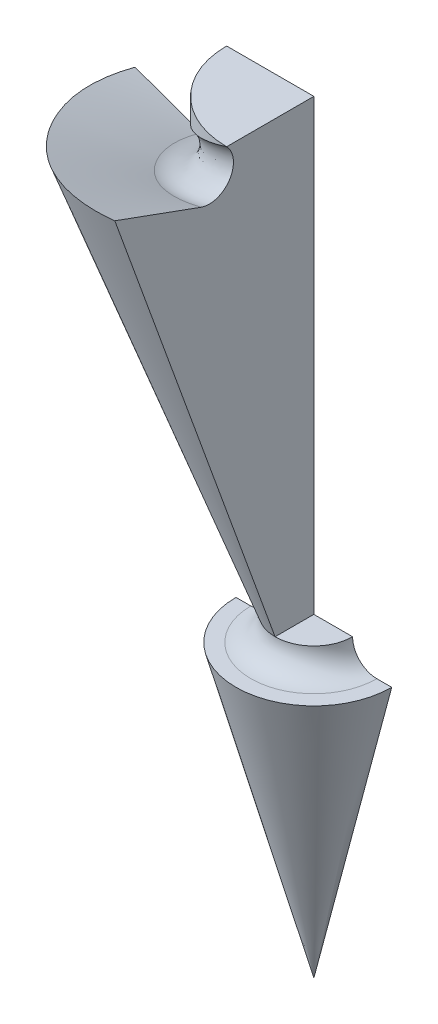
ISO-10303-21;
HEADER;
FILE_DESCRIPTION(('STEP AP214'),'2;1');
FILE_NAME('part.step','',(''),(''),'','','');
FILE_SCHEMA(('AUTOMOTIVE_DESIGN { 1 0 10303 214 1 1 1 1 }'));
ENDSEC;
DATA;
#1=APPLICATION_CONTEXT('core data for automotive mechanical design processes');
#2=APPLICATION_PROTOCOL_DEFINITION('international standard','automotive_design',2000,#1);
#3=PRODUCT_CONTEXT('',#1,'mechanical');
#4=PRODUCT('Part','Part','',(#3));
#5=PRODUCT_RELATED_PRODUCT_CATEGORY('part','',(#4));
#6=PRODUCT_DEFINITION_FORMATION('','',#4);
#7=PRODUCT_DEFINITION_CONTEXT('part definition',#1,'design');
#8=PRODUCT_DEFINITION('design','',#6,#7);
#9=PRODUCT_DEFINITION_SHAPE('','',#8);
#10=(LENGTH_UNIT() NAMED_UNIT(*) SI_UNIT(.MILLI.,.METRE.));
#11=(NAMED_UNIT(*) PLANE_ANGLE_UNIT() SI_UNIT($,.RADIAN.));
#12=(NAMED_UNIT(*) SI_UNIT($,.STERADIAN.) SOLID_ANGLE_UNIT());
#13=UNCERTAINTY_MEASURE_WITH_UNIT(LENGTH_MEASURE(1.E-05),#10,'distance_accuracy_value','');
#14=(GEOMETRIC_REPRESENTATION_CONTEXT(3) GLOBAL_UNCERTAINTY_ASSIGNED_CONTEXT((#13)) GLOBAL_UNIT_ASSIGNED_CONTEXT((#10,
#11,#12)) REPRESENTATION_CONTEXT('',''));
#15=CARTESIAN_POINT('',(0.,0.,0.));
#16=DIRECTION('',(0.,0.,1.));
#17=DIRECTION('',(1.,0.,0.));
#18=AXIS2_PLACEMENT_3D('',#15,#16,#17);
#19=CARTESIAN_POINT('',(0.65,3.25,0.));
#20=DIRECTION('',(0.,0.,1.));
#21=DIRECTION('',(1.,0.,0.));
#22=AXIS2_PLACEMENT_3D('',#19,#20,#21);
#23=PLANE('',#22);
#24=DIRECTION('',(0.939692620785907,-0.342020143325673,0.));
#25=VECTOR('',#24,1.);
#26=CARTESIAN_POINT('',(-2.05422252667127,7.29493903878258,0.));
#27=LINE('',#26,#25);
#28=CARTESIAN_POINT('',(-1.84444761887696,7.21858721644951,0.));
#29=VERTEX_POINT('',#28);
#30=CARTESIAN_POINT('',(-1.16533998591608,6.97141225218877,0.));
#31=VERTEX_POINT('',#30);
#32=EDGE_CURVE('E105',#29,#31,#27,.T.);
#33=ORIENTED_EDGE('',*,*,#32,.T.);
#34=CARTESIAN_POINT('',(-1.07983495008466,7.20633540738525,0.));
#35=DIRECTION('',(0.,0.,1.));
#36=DIRECTION('',(1.,0.,0.));
#37=AXIS2_PLACEMENT_3D('',#34,#35,#36);
#38=CIRCLE('',#37,0.25);
#39=CARTESIAN_POINT('',(-0.9,7.38,0.));
#40=VERTEX_POINT('',#39);
#41=EDGE_CURVE('E298',#31,#40,#38,.T.);
#42=ORIENTED_EDGE('',*,*,#41,.T.);
#43=DIRECTION('',(0.,1.,0.));
#44=VECTOR('',#43,1.);
#45=CARTESIAN_POINT('',(-0.9,7.38,0.));
#46=LINE('',#45,#44);
#47=CARTESIAN_POINT('',(-0.9,7.88,0.));
#48=VERTEX_POINT('',#47);
#49=EDGE_CURVE('E110',#40,#48,#46,.T.);
#50=ORIENTED_EDGE('',*,*,#49,.T.);
#51=DIRECTION('',(-1.,0.,0.));
#52=VECTOR('',#51,1.);
#53=CARTESIAN_POINT('',(0.,7.88,0.));
#54=LINE('',#53,#52);
#55=CARTESIAN_POINT('',(0.,7.88,0.));
#56=VERTEX_POINT('',#55);
#57=EDGE_CURVE('E124',#56,#48,#54,.T.);
#58=ORIENTED_EDGE('',*,*,#57,.F.);
#59=DIRECTION('',(0.,1.,0.));
#60=VECTOR('',#59,1.);
#61=CARTESIAN_POINT('',(0.,2.15100903221813,0.));
#62=LINE('',#61,#60);
#63=CARTESIAN_POINT('',(0.,3.25,0.));
#64=VERTEX_POINT('',#63);
#65=EDGE_CURVE('E54',#64,#56,#62,.T.);
#66=ORIENTED_EDGE('',*,*,#65,.F.);
#67=DIRECTION('',(1.,0.,0.));
#68=VECTOR('',#67,1.);
#69=CARTESIAN_POINT('',(0.,3.25,0.));
#70=LINE('',#69,#68);
#71=CARTESIAN_POINT('',(0.4,3.25,0.));
#72=VERTEX_POINT('',#71);
#73=EDGE_CURVE('E147',#64,#72,#70,.T.);
#74=ORIENTED_EDGE('',*,*,#73,.T.);
#75=CARTESIAN_POINT('',(0.65,3.25,0.));
#76=DIRECTION('',(0.,0.,1.));
#77=DIRECTION('',(1.,0.,0.));
#78=AXIS2_PLACEMENT_3D('',#75,#76,#77);
#79=CIRCLE('',#78,0.25);
#80=CARTESIAN_POINT('',(0.65,3.,0.));
#81=VERTEX_POINT('',#80);
#82=EDGE_CURVE('E149',#72,#81,#79,.T.);
#83=ORIENTED_EDGE('',*,*,#82,.T.);
#84=DIRECTION('',(1.,0.,0.));
#85=VECTOR('',#84,1.);
#86=CARTESIAN_POINT('',(0.65,3.,0.));
#87=LINE('',#86,#85);
#88=CARTESIAN_POINT('',(0.803847577293347,3.,0.));
#89=VERTEX_POINT('',#88);
#90=EDGE_CURVE('E152',#81,#89,#87,.T.);
#91=ORIENTED_EDGE('',*,*,#90,.T.);
#92=DIRECTION('',(-0.258819045102515,-0.96592582628907,0.));
#93=VECTOR('',#92,1.);
#94=CARTESIAN_POINT('',(0.803847577293347,3.,0.));
#95=LINE('',#94,#93);
#96=CARTESIAN_POINT('',(0.,0.,0.));
#97=VERTEX_POINT('',#96);
#98=EDGE_CURVE('E144',#89,#97,#95,.T.);
#99=ORIENTED_EDGE('',*,*,#98,.T.);
#100=DIRECTION('',(0.258819045102515,-0.96592582628907,0.));
#101=VECTOR('',#100,1.);
#102=CARTESIAN_POINT('',(-0.803847577293347,3.,0.));
#103=LINE('',#102,#101);
#104=CARTESIAN_POINT('',(-0.803847577293347,3.,0.));
#105=VERTEX_POINT('',#104);
#106=EDGE_CURVE('E136',#105,#97,#103,.T.);
#107=ORIENTED_EDGE('',*,*,#106,.F.);
#108=DIRECTION('',(-1.,0.,0.));
#109=VECTOR('',#108,1.);
#110=CARTESIAN_POINT('',(-0.65,3.,0.));
#111=LINE('',#110,#109);
#112=CARTESIAN_POINT('',(-0.65,3.,0.));
#113=VERTEX_POINT('',#112);
#114=EDGE_CURVE('E141',#113,#105,#111,.T.);
#115=ORIENTED_EDGE('',*,*,#114,.F.);
#116=CARTESIAN_POINT('',(-0.65,3.25,0.));
#117=DIRECTION('',(0.,0.,-1.));
#118=DIRECTION('',(-1.,0.,0.));
#119=AXIS2_PLACEMENT_3D('',#116,#117,#118);
#120=CIRCLE('',#119,0.25);
#121=CARTESIAN_POINT('',(-0.4,3.25,0.));
#122=VERTEX_POINT('',#121);
#123=EDGE_CURVE('E138',#122,#113,#120,.T.);
#124=ORIENTED_EDGE('',*,*,#123,.F.);
#125=DIRECTION('',(0.342020143325663,-0.939692620785911,0.));
#126=VECTOR('',#125,1.);
#127=CARTESIAN_POINT('',(-2.08518218465248,7.88,0.));
#128=LINE('',#127,#126);
#129=EDGE_CURVE('E109',#29,#122,#128,.T.);
#130=ORIENTED_EDGE('',*,*,#129,.F.);
#131=EDGE_LOOP('',(#33,#42,#50,#58,#66,#74,#83,#91,#99,#107,#115,#124,#130));
#132=FACE_BOUND('',#131,.T.);
#133=ADVANCED_FACE('F32',(#132),#23,.F.);
#134=CARTESIAN_POINT('',(0.,7.88,0.));
#135=DIRECTION('',(0.,1.,0.));
#136=DIRECTION('',(0.,0.,1.));
#137=AXIS2_PLACEMENT_3D('',#134,#135,#136);
#138=CONICAL_SURFACE('',#137,2.08518218465248,0.34906585039886);
#139=CARTESIAN_POINT('',(-1.84444761887696,7.21858721644951,0.));
#140=CARTESIAN_POINT('',(-1.84781471181397,7.22784298486972,0.0444304817928109));
#141=CARTESIAN_POINT('',(-1.84956840188651,7.23707024375933,0.0889683857329345));
#142=CARTESIAN_POINT('',(-1.84983885491136,7.25542953451838,0.178060540194713));
#143=CARTESIAN_POINT('',(-1.84835652285926,7.26456159229438,0.222614782662941));
#144=CARTESIAN_POINT('',(-1.83905486371803,7.29172727015378,0.355854667817407));
#145=CARTESIAN_POINT('',(-1.82639509414649,7.30956964025187,0.444305988826253));
#146=CARTESIAN_POINT('',(-1.79614387865713,7.3372744279236,0.58297518639799));
#147=CARTESIAN_POINT('',(-1.78266444553973,7.34742578708997,0.634085028649661));
#148=CARTESIAN_POINT('',(-1.75133533893838,7.36735735314818,0.735025826969175));
#149=CARTESIAN_POINT('',(-1.73348710712139,7.37713768124998,0.784857198940521));
#150=CARTESIAN_POINT('',(-1.70353106913082,7.39151116660467,0.858374034844452));
#151=CARTESIAN_POINT('',(-1.69300793153647,7.39625554865905,0.882688643430426));
#152=CARTESIAN_POINT('',(-1.67090076326795,7.40559434110859,0.930856361012279));
#153=CARTESIAN_POINT('',(-1.65931691907333,7.41018877767327,0.954709550239116));
#154=CARTESIAN_POINT('',(-1.63520023638637,7.41945297862087,1.00192042869882));
#155=CARTESIAN_POINT('',(-1.62266723882482,7.42412275552645,1.02527803403304));
#156=CARTESIAN_POINT('',(-1.59668461578408,7.43355008637108,1.07145953373859));
#157=CARTESIAN_POINT('',(-1.58323493708113,7.43830764539516,1.09428339701661));
#158=CARTESIAN_POINT('',(-1.54120506317018,7.45280584124422,1.16244232112663));
#159=CARTESIAN_POINT('',(-1.51122948280328,7.46266230768552,1.20690555842916));
#160=CARTESIAN_POINT('',(-1.44781841069014,7.48260350922582,1.29320616344966));
#161=CARTESIAN_POINT('',(-1.41438321277737,7.49268822488233,1.33504375368593));
#162=CARTESIAN_POINT('',(-1.30918566464524,7.5231816082672,1.45624204409056));
#163=CARTESIAN_POINT('',(-1.23248968225225,7.54384389151072,1.53135567963995));
#164=CARTESIAN_POINT('',(-1.06329397173253,7.58644347522577,1.67211421517855));
#165=CARTESIAN_POINT('',(-0.970139524130376,7.60838584058901,1.73696740588334));
#166=CARTESIAN_POINT('',(-0.774030802814063,7.65177088047946,1.84988273640024));
#167=CARTESIAN_POINT('',(-0.671077423342969,7.67321360038203,1.89794640654522));
#168=CARTESIAN_POINT('',(-0.474256700358971,7.71189946447853,1.96999622436579));
#169=CARTESIAN_POINT('',(-0.381333578416707,7.72929103700932,1.99650841962133));
#170=CARTESIAN_POINT('',(-0.192465633964743,7.76299638698439,2.03579516224844));
#171=CARTESIAN_POINT('',(-0.0965215584160749,7.77931042781639,2.04857307852527));
#172=CARTESIAN_POINT('',(0.,7.79493903878258,2.05422252667127));
#173=B_SPLINE_CURVE_WITH_KNOTS('',3,(#139,#140,#141,#142,#143,#144,#145,#146,#147,#148,#149,
#150,#151,#152,#153,#154,#155,#156,#157,#158,#159,#160,#161,#162,#163,#164,#165,#166,#167,#168,
#169,#170,#171,#172),.UNSPECIFIED.,.F.,.F.,(4,2,2,2,2,2,2,2,2,2,2,2,2,2,2,2,4),(0.,
0.136457669262505,0.27287718125609,0.545142011443245,0.706456766055463,0.867718359746195,
0.948444823416402,1.029157121967,1.10988297720473,1.1906135234954,1.3539812697316,
1.51733515213201,1.8438039843095,2.18902516221494,2.53421486565076,2.82777405417575,
3.12126121861064),.UNSPECIFIED.);
#174=CARTESIAN_POINT('',(0.,7.79493903878258,2.05422252667127));
#175=VERTEX_POINT('',#174);
#176=EDGE_CURVE('E98',#29,#175,#173,.T.);
#177=ORIENTED_EDGE('',*,*,#176,.F.);
#178=ORIENTED_EDGE('',*,*,#129,.T.);
#179=CARTESIAN_POINT('',(0.,3.25,0.));
#180=DIRECTION('',(0.,-1.,0.));
#181=DIRECTION('',(0.,0.,-1.));
#182=AXIS2_PLACEMENT_3D('',#179,#180,#181);
#183=CIRCLE('',#182,0.4);
#184=CARTESIAN_POINT('',(0.,3.25,0.4));
#185=VERTEX_POINT('',#184);
#186=EDGE_CURVE('E122',#122,#185,#183,.F.);
#187=ORIENTED_EDGE('',*,*,#186,.T.);
#188=DIRECTION('',(0.,-0.939692620785911,-0.342020143325663));
#189=VECTOR('',#188,1.);
#190=CARTESIAN_POINT('',(0.,7.88,2.08518218465248));
#191=LINE('',#190,#189);
#192=EDGE_CURVE('E115',#175,#185,#191,.T.);
#193=ORIENTED_EDGE('',*,*,#192,.F.);
#194=EDGE_LOOP('',(#177,#178,#187,#193));
#195=FACE_BOUND('',#194,.T.);
#196=ADVANCED_FACE('F120',(#195),#138,.T.);
#197=CARTESIAN_POINT('',(0.,0.,0.));
#198=DIRECTION('',(-1.,0.,0.));
#199=DIRECTION('',(0.,0.,1.));
#200=AXIS2_PLACEMENT_3D('',#197,#198,#199);
#201=PLANE('',#200);
#202=DIRECTION('',(0.,-0.342020143325672,-0.939692620785907));
#203=VECTOR('',#202,1.);
#204=CARTESIAN_POINT('',(0.,7.79493903878258,2.05422252667127));
#205=LINE('',#204,#203);
#206=CARTESIAN_POINT('',(0.,7.47141225218877,1.16533998591608));
#207=VERTEX_POINT('',#206);
#208=EDGE_CURVE('E102',#175,#207,#205,.T.);
#209=ORIENTED_EDGE('',*,*,#208,.F.);
#210=ORIENTED_EDGE('',*,*,#192,.T.);
#211=DIRECTION('',(0.,0.,-1.));
#212=VECTOR('',#211,1.);
#213=CARTESIAN_POINT('',(0.,3.25,0.));
#214=LINE('',#213,#212);
#215=EDGE_CURVE('E133',#185,#64,#214,.T.);
#216=ORIENTED_EDGE('',*,*,#215,.T.);
#217=ORIENTED_EDGE('',*,*,#65,.T.);
#218=DIRECTION('',(0.,0.,1.));
#219=VECTOR('',#218,1.);
#220=CARTESIAN_POINT('',(0.,7.88,0.));
#221=LINE('',#220,#219);
#222=CARTESIAN_POINT('',(0.,7.88,0.9));
#223=VERTEX_POINT('',#222);
#224=EDGE_CURVE('E126',#56,#223,#221,.T.);
#225=ORIENTED_EDGE('',*,*,#224,.T.);
#226=CARTESIAN_POINT('',(0.,7.70633540738525,1.07983495008466));
#227=DIRECTION('',(1.,0.,0.));
#228=DIRECTION('',(0.,0.,-1.));
#229=AXIS2_PLACEMENT_3D('',#226,#227,#228);
#230=CIRCLE('',#229,0.25);
#231=EDGE_CURVE('E118',#207,#223,#230,.T.);
#232=ORIENTED_EDGE('',*,*,#231,.F.);
#233=EDGE_LOOP('',(#209,#210,#216,#217,#225,#232));
#234=FACE_BOUND('',#233,.T.);
#235=ADVANCED_FACE('F114',(#234),#201,.F.);
#236=CARTESIAN_POINT('',(0.,7.88,0.));
#237=DIRECTION('',(0.,-1.,0.));
#238=DIRECTION('',(0.,0.,-1.));
#239=AXIS2_PLACEMENT_3D('',#236,#237,#238);
#240=PLANE('',#239);
#241=CARTESIAN_POINT('',(0.,7.88,0.));
#242=DIRECTION('',(0.,-1.,0.));
#243=DIRECTION('',(0.,0.,-1.));
#244=AXIS2_PLACEMENT_3D('',#241,#242,#243);
#245=CIRCLE('',#244,0.9);
#246=EDGE_CURVE('E11',#223,#48,#245,.T.);
#247=ORIENTED_EDGE('',*,*,#246,.F.);
#248=ORIENTED_EDGE('',*,*,#224,.F.);
#249=ORIENTED_EDGE('',*,*,#57,.T.);
#250=EDGE_LOOP('',(#247,#248,#249));
#251=FACE_BOUND('',#250,.T.);
#252=ADVANCED_FACE('F209',(#251),#240,.F.);
#253=CARTESIAN_POINT('',(0.,3.25,0.));
#254=DIRECTION('',(0.,-1.,0.));
#255=DIRECTION('',(0.,0.,-1.));
#256=AXIS2_PLACEMENT_3D('',#253,#254,#255);
#257=PLANE('',#256);
#258=ORIENTED_EDGE('',*,*,#215,.F.);
#259=CARTESIAN_POINT('',(0.,3.25,0.));
#260=DIRECTION('',(0.,-1.,0.));
#261=DIRECTION('',(0.,0.,-1.));
#262=AXIS2_PLACEMENT_3D('',#259,#260,#261);
#263=CIRCLE('',#262,0.4);
#264=EDGE_CURVE('E155',#72,#185,#263,.T.);
#265=ORIENTED_EDGE('',*,*,#264,.F.);
#266=ORIENTED_EDGE('',*,*,#73,.F.);
#267=EDGE_LOOP('',(#258,#265,#266));
#268=FACE_BOUND('',#267,.T.);
#269=ADVANCED_FACE('F214',(#268),#257,.F.);
#270=CARTESIAN_POINT('',(0.,3.,0.));
#271=DIRECTION('',(0.,1.,0.));
#272=DIRECTION('',(0.,0.,1.));
#273=AXIS2_PLACEMENT_3D('',#270,#271,#272);
#274=CONICAL_SURFACE('',#273,0.803847577293347,0.261799387799143);
#275=CARTESIAN_POINT('',(0.,3.,0.));
#276=DIRECTION('',(0.,-1.,0.));
#277=DIRECTION('',(0.,0.,-1.));
#278=AXIS2_PLACEMENT_3D('',#275,#276,#277);
#279=CIRCLE('',#278,0.803847577293347);
#280=EDGE_CURVE('E40',#89,#105,#279,.T.);
#281=ORIENTED_EDGE('',*,*,#280,.T.);
#282=ORIENTED_EDGE('',*,*,#106,.T.);
#283=ORIENTED_EDGE('',*,*,#98,.F.);
#284=EDGE_LOOP('',(#281,#282,#283));
#285=FACE_BOUND('',#284,.T.);
#286=ADVANCED_FACE('F161',(#285),#274,.T.);
#287=CARTESIAN_POINT('',(0.65,3.,0.));
#288=DIRECTION('',(0.,-1.,0.));
#289=DIRECTION('',(0.,0.,-1.));
#290=AXIS2_PLACEMENT_3D('',#287,#288,#289);
#291=PLANE('',#290);
#292=CARTESIAN_POINT('',(0.,3.,0.));
#293=DIRECTION('',(0.,-1.,0.));
#294=DIRECTION('',(0.,0.,-1.));
#295=AXIS2_PLACEMENT_3D('',#292,#293,#294);
#296=CIRCLE('',#295,0.65);
#297=EDGE_CURVE('E158',#81,#113,#296,.T.);
#298=ORIENTED_EDGE('',*,*,#297,.T.);
#299=ORIENTED_EDGE('',*,*,#114,.T.);
#300=ORIENTED_EDGE('',*,*,#280,.F.);
#301=ORIENTED_EDGE('',*,*,#90,.F.);
#302=EDGE_LOOP('',(#298,#299,#300,#301));
#303=FACE_BOUND('',#302,.T.);
#304=ADVANCED_FACE('F34',(#303),#291,.F.);
#305=CARTESIAN_POINT('',(0.,3.25,0.));
#306=DIRECTION('',(0.,-1.,0.));
#307=DIRECTION('',(0.,0.,-1.));
#308=AXIS2_PLACEMENT_3D('',#305,#306,#307);
#309=TOROIDAL_SURFACE('',#308,0.65,0.25);
#310=ORIENTED_EDGE('',*,*,#264,.T.);
#311=ORIENTED_EDGE('',*,*,#186,.F.);
#312=ORIENTED_EDGE('',*,*,#123,.T.);
#313=ORIENTED_EDGE('',*,*,#297,.F.);
#314=ORIENTED_EDGE('',*,*,#82,.F.);
#315=EDGE_LOOP('',(#310,#311,#312,#313,#314));
#316=FACE_BOUND('',#315,.T.);
#317=ADVANCED_FACE('F171',(#316),#309,.F.);
#318=CARTESIAN_POINT('',(0.,7.79493903878258,2.05422252667127));
#319=CARTESIAN_POINT('',(-1.18600592874905,7.62827237211591,2.05422252667128));
#320=CARTESIAN_POINT('',(-1.77900889312358,7.46160570544925,1.02711126333564));
#321=CARTESIAN_POINT('',(-2.37201185749811,7.29493903878258,0.));
#322=CARTESIAN_POINT('',(-1.77900889312358,7.12827237211592,-1.02711126333563));
#323=CARTESIAN_POINT('',(0.,7.47141225218877,1.16533998591608));
#324=CARTESIAN_POINT('',(-0.67280935456608,7.30474558552211,1.16533998591608));
#325=CARTESIAN_POINT('',(-1.00921403184912,7.13807891885544,0.582669992958044));
#326=CARTESIAN_POINT('',(-1.34561870913217,6.97141225218877,0.));
#327=CARTESIAN_POINT('',(-1.00921403184913,6.80474558552211,-0.582669992958037));
#328=(BOUNDED_SURFACE() B_SPLINE_SURFACE(1,2,((#318,#319,#320,#321,#322),(#323,#324,#325,#326,
#327)),.UNSPECIFIED.,.F.,.F.,.F.) B_SPLINE_SURFACE_WITH_KNOTS((2,2),(3,2,3),(0.,1.),(0.,0.5,1.),
.UNSPECIFIED.) GEOMETRIC_REPRESENTATION_ITEM() RATIONAL_B_SPLINE_SURFACE(((1.,0.866025403784439,
1.,0.866025403784439,1.),(1.,0.866025403784439,1.,0.866025403784439,1.))) REPRESENTATION_ITEM('') SURFACE());
#329=CARTESIAN_POINT('',(0.,7.47141225218877,1.16533998591608));
#330=CARTESIAN_POINT('',(-0.67280935456608,7.30474558552211,1.16533998591608));
#331=CARTESIAN_POINT('',(-1.00921403184912,7.13807891885544,0.582669992958044));
#332=CARTESIAN_POINT('',(-1.34561870913217,6.97141225218877,0.));
#333=CARTESIAN_POINT('',(-1.00921403184913,6.80474558552211,-0.582669992958037));
#334=(BOUNDED_CURVE() B_SPLINE_CURVE(2,(#329,#330,#331,#332,#333),.UNSPECIFIED.,.F.,
.F.) B_SPLINE_CURVE_WITH_KNOTS((3,2,3),(0.,0.5,1.),
.UNSPECIFIED.) CURVE() GEOMETRIC_REPRESENTATION_ITEM() RATIONAL_B_SPLINE_CURVE((1.,
0.866025403784439,1.,0.866025403784439,1.)) REPRESENTATION_ITEM(''));
#335=EDGE_CURVE('E299',#207,#31,#334,.T.);
#336=ORIENTED_EDGE('',*,*,#176,.T.);
#337=ORIENTED_EDGE('',*,*,#208,.T.);
#338=ORIENTED_EDGE('',*,*,#335,.T.);
#339=ORIENTED_EDGE('',*,*,#32,.F.);
#340=EDGE_LOOP('',(#336,#337,#338,#339));
#341=FACE_BOUND('',#340,.T.);
#342=ADVANCED_FACE('F100',(#341),#328,.T.);
#343=CARTESIAN_POINT('',(0.,7.88,0.));
#344=DIRECTION('',(0.,-1.,0.));
#345=DIRECTION('',(0.,0.,-1.));
#346=AXIS2_PLACEMENT_3D('',#343,#344,#345);
#347=CYLINDRICAL_SURFACE('',#346,0.9);
#348=ORIENTED_EDGE('',*,*,#246,.T.);
#349=ORIENTED_EDGE('',*,*,#49,.F.);
#350=CARTESIAN_POINT('',(0.,7.88,0.9));
#351=CARTESIAN_POINT('',(-0.51961524227066,7.71333333333333,0.900000000000002));
#352=CARTESIAN_POINT('',(-0.779422863405994,7.54666666666667,0.450000000000003));
#353=CARTESIAN_POINT('',(-1.03923048454133,7.38,0.));
#354=CARTESIAN_POINT('',(-0.779422863405997,7.21333333333333,-0.449999999999998));
#355=(BOUNDED_CURVE() B_SPLINE_CURVE(2,(#350,#351,#352,#353,#354),.UNSPECIFIED.,.F.,
.F.) B_SPLINE_CURVE_WITH_KNOTS((3,2,3),(0.,0.5,1.),
.UNSPECIFIED.) CURVE() GEOMETRIC_REPRESENTATION_ITEM() RATIONAL_B_SPLINE_CURVE((1.,
0.866025403784439,1.,0.866025403784439,1.)) REPRESENTATION_ITEM(''));
#356=EDGE_CURVE('E46',#223,#40,#355,.T.);
#357=ORIENTED_EDGE('',*,*,#356,.F.);
#358=EDGE_LOOP('',(#348,#349,#357));
#359=FACE_BOUND('',#358,.T.);
#360=ADVANCED_FACE('F188',(#359),#347,.T.);
#361=CARTESIAN_POINT('',(0.,7.47141225218877,1.16533998591608));
#362=CARTESIAN_POINT('',(-0.67280935456608,7.30474558552211,1.16533998591608));
#363=CARTESIAN_POINT('',(-1.00921403184912,7.13807891885544,0.582669992958044));
#364=CARTESIAN_POINT('',(-1.34561870913217,6.97141225218877,0.));
#365=CARTESIAN_POINT('',(-1.00921403184913,6.80474558552211,-0.582669992958037));
#366=CARTESIAN_POINT('',(0.,7.35648925593501,0.849591648732797));
#367=CARTESIAN_POINT('',(-0.490511967097135,7.18982258926834,0.849591648732799));
#368=CARTESIAN_POINT('',(-0.735767950645706,7.02315592260167,0.424795824366401));
#369=CARTESIAN_POINT('',(-0.981023934194277,6.85648925593501,0.));
#370=CARTESIAN_POINT('',(-0.735767950645709,6.68982258926834,-0.424795824366396));
#371=CARTESIAN_POINT('',(0.,7.63829293451647,0.666586200071001));
#372=CARTESIAN_POINT('',(-0.38485372204908,7.47162626784981,0.666586200071002));
#373=CARTESIAN_POINT('',(-0.577280583073623,7.30495960118314,0.333293100035503));
#374=CARTESIAN_POINT('',(-0.769707444098165,7.13829293451647,0.));
#375=CARTESIAN_POINT('',(-0.577280583073625,6.97162626784981,-0.333293100035499));
#376=CARTESIAN_POINT('',(0.,7.88,0.9));
#377=CARTESIAN_POINT('',(-0.51961524227066,7.71333333333333,0.900000000000002));
#378=CARTESIAN_POINT('',(-0.779422863405994,7.54666666666667,0.450000000000003));
#379=CARTESIAN_POINT('',(-1.03923048454133,7.38,0.));
#380=CARTESIAN_POINT('',(-0.779422863405997,7.21333333333333,-0.449999999999998));
#381=(BOUNDED_SURFACE() B_SPLINE_SURFACE(3,2,((#361,#362,#363,#364,#365),(#366,#367,#368,#369,
#370),(#371,#372,#373,#374,#375),(#376,#377,#378,#379,#380)),.UNSPECIFIED.,.F.,.F.,
.F.) B_SPLINE_SURFACE_WITH_KNOTS((4,4),(3,2,3),(0.,1.),(0.,0.5,1.),
.UNSPECIFIED.) GEOMETRIC_REPRESENTATION_ITEM() RATIONAL_B_SPLINE_SURFACE(((1.,0.866025403784439,
1.,0.866025403784439,1.),(0.483300702895908,0.418550686374732,0.483300702895908,
0.418550686374732,0.483300702895908),(0.483300702895908,0.418550686374732,0.483300702895908,
0.418550686374732,0.483300702895908),(1.,0.866025403784439,1.,0.866025403784439,1.))) REPRESENTATION_ITEM('') SURFACE());
#382=ORIENTED_EDGE('',*,*,#356,.T.);
#383=ORIENTED_EDGE('',*,*,#41,.F.);
#384=ORIENTED_EDGE('',*,*,#335,.F.);
#385=ORIENTED_EDGE('',*,*,#231,.T.);
#386=EDGE_LOOP('',(#382,#383,#384,#385));
#387=FACE_BOUND('',#386,.T.);
#388=ADVANCED_FACE('F189',(#387),#381,.T.);
#389=CLOSED_SHELL('',(#133,#196,#235,#252,#269,#286,#304,#317,#342,#360,#388));
#390=MANIFOLD_SOLID_BREP('B2',#389);
#391=ADVANCED_BREP_SHAPE_REPRESENTATION('',(#18,#390),#14);
#392=SHAPE_DEFINITION_REPRESENTATION(#9,#391);
ENDSEC;
END-ISO-10303-21;
